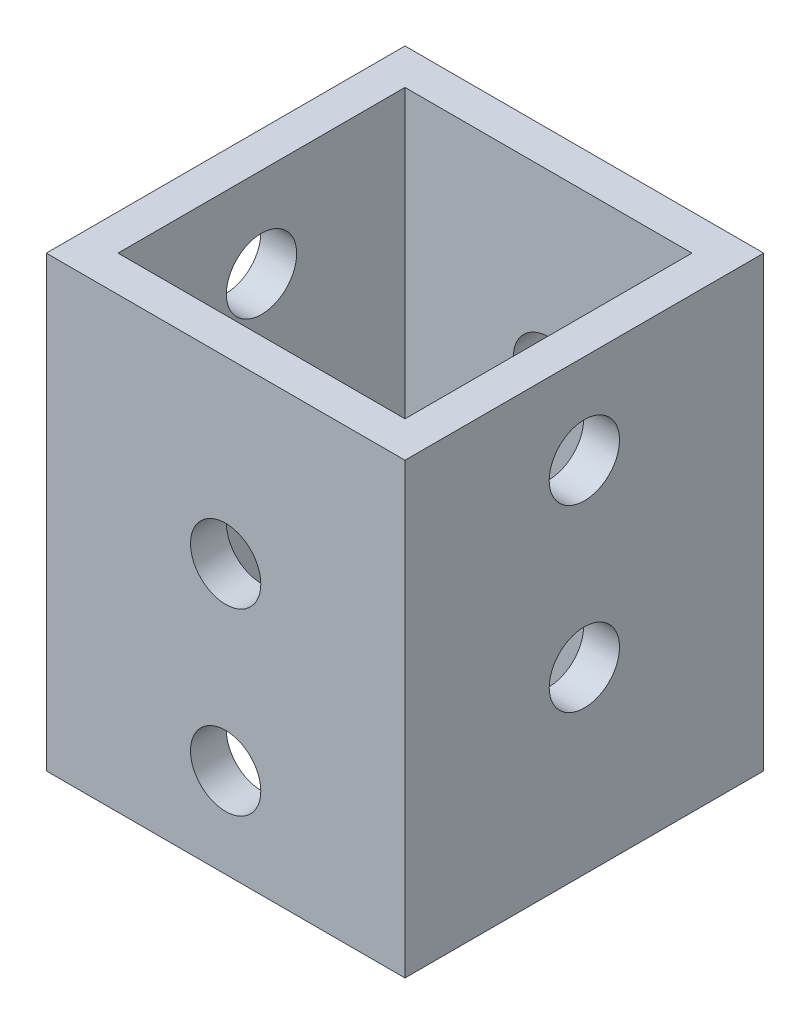
ISO-10303-21;
HEADER;
FILE_DESCRIPTION(('STEP AP214'),'2;1');
FILE_NAME('part.step','',(''),(''),'','','');
FILE_SCHEMA(('AUTOMOTIVE_DESIGN { 1 0 10303 214 1 1 1 1 }'));
ENDSEC;
DATA;
#1=APPLICATION_CONTEXT('core data for automotive mechanical design processes');
#2=APPLICATION_PROTOCOL_DEFINITION('international standard','automotive_design',2000,#1);
#3=PRODUCT_CONTEXT('',#1,'mechanical');
#4=PRODUCT('Part','Part','',(#3));
#5=PRODUCT_RELATED_PRODUCT_CATEGORY('part','',(#4));
#6=PRODUCT_DEFINITION_FORMATION('','',#4);
#7=PRODUCT_DEFINITION_CONTEXT('part definition',#1,'design');
#8=PRODUCT_DEFINITION('design','',#6,#7);
#9=PRODUCT_DEFINITION_SHAPE('','',#8);
#10=(LENGTH_UNIT() NAMED_UNIT(*) SI_UNIT(.MILLI.,.METRE.));
#11=(NAMED_UNIT(*) PLANE_ANGLE_UNIT() SI_UNIT($,.RADIAN.));
#12=(NAMED_UNIT(*) SI_UNIT($,.STERADIAN.) SOLID_ANGLE_UNIT());
#13=UNCERTAINTY_MEASURE_WITH_UNIT(LENGTH_MEASURE(1.E-05),#10,'distance_accuracy_value','');
#14=(GEOMETRIC_REPRESENTATION_CONTEXT(3) GLOBAL_UNCERTAINTY_ASSIGNED_CONTEXT((#13)) GLOBAL_UNIT_ASSIGNED_CONTEXT((#10,
#11,#12)) REPRESENTATION_CONTEXT('',''));
#15=CARTESIAN_POINT('',(0.,0.,0.));
#16=DIRECTION('',(0.,0.,1.));
#17=DIRECTION('',(1.,0.,0.));
#18=AXIS2_PLACEMENT_3D('',#15,#16,#17);
#19=CARTESIAN_POINT('',(0.,31.75,0.));
#20=DIRECTION('',(0.,1.,0.));
#21=DIRECTION('',(0.,0.,1.));
#22=AXIS2_PLACEMENT_3D('',#19,#20,#21);
#23=PLANE('',#22);
#24=DIRECTION('',(0.,0.,1.));
#25=VECTOR('',#24,1.);
#26=CARTESIAN_POINT('',(0.,31.75,0.));
#27=LINE('',#26,#25);
#28=CARTESIAN_POINT('',(0.,31.75,-25.4));
#29=VERTEX_POINT('',#28);
#30=CARTESIAN_POINT('',(0.,31.75,0.));
#31=VERTEX_POINT('',#30);
#32=EDGE_CURVE('E162',#29,#31,#27,.T.);
#33=ORIENTED_EDGE('',*,*,#32,.T.);
#34=DIRECTION('',(1.,0.,0.));
#35=VECTOR('',#34,1.);
#36=CARTESIAN_POINT('',(0.,31.75,0.));
#37=LINE('',#36,#35);
#38=CARTESIAN_POINT('',(25.4,31.75,0.));
#39=VERTEX_POINT('',#38);
#40=EDGE_CURVE('E165',#31,#39,#37,.T.);
#41=ORIENTED_EDGE('',*,*,#40,.T.);
#42=DIRECTION('',(0.,0.,-1.));
#43=VECTOR('',#42,1.);
#44=CARTESIAN_POINT('',(25.4,31.75,0.));
#45=LINE('',#44,#43);
#46=CARTESIAN_POINT('',(25.4,31.75,-25.4));
#47=VERTEX_POINT('',#46);
#48=EDGE_CURVE('E168',#39,#47,#45,.T.);
#49=ORIENTED_EDGE('',*,*,#48,.T.);
#50=DIRECTION('',(-1.,0.,0.));
#51=VECTOR('',#50,1.);
#52=CARTESIAN_POINT('',(0.,31.75,-25.4));
#53=LINE('',#52,#51);
#54=EDGE_CURVE('E170',#47,#29,#53,.T.);
#55=ORIENTED_EDGE('',*,*,#54,.T.);
#56=EDGE_LOOP('',(#33,#41,#49,#55));
#57=FACE_BOUND('',#56,.T.);
#58=DIRECTION('',(1.,0.,0.));
#59=VECTOR('',#58,1.);
#60=CARTESIAN_POINT('',(0.,31.75,-2.54));
#61=LINE('',#60,#59);
#62=CARTESIAN_POINT('',(2.54,31.75,-2.54));
#63=VERTEX_POINT('',#62);
#64=CARTESIAN_POINT('',(22.86,31.75,-2.54));
#65=VERTEX_POINT('',#64);
#66=EDGE_CURVE('E132',#63,#65,#61,.T.);
#67=ORIENTED_EDGE('',*,*,#66,.F.);
#68=DIRECTION('',(0.,0.,1.));
#69=VECTOR('',#68,1.);
#70=CARTESIAN_POINT('',(2.54,31.75,0.));
#71=LINE('',#70,#69);
#72=CARTESIAN_POINT('',(2.54,31.75,-22.86));
#73=VERTEX_POINT('',#72);
#74=EDGE_CURVE('E124',#73,#63,#71,.T.);
#75=ORIENTED_EDGE('',*,*,#74,.F.);
#76=DIRECTION('',(-1.,0.,0.));
#77=VECTOR('',#76,1.);
#78=CARTESIAN_POINT('',(0.,31.75,-22.86));
#79=LINE('',#78,#77);
#80=CARTESIAN_POINT('',(22.86,31.75,-22.86));
#81=VERTEX_POINT('',#80);
#82=EDGE_CURVE('E146',#81,#73,#79,.T.);
#83=ORIENTED_EDGE('',*,*,#82,.F.);
#84=DIRECTION('',(0.,0.,-1.));
#85=VECTOR('',#84,1.);
#86=CARTESIAN_POINT('',(22.86,31.75,0.));
#87=LINE('',#86,#85);
#88=EDGE_CURVE('E144',#65,#81,#87,.T.);
#89=ORIENTED_EDGE('',*,*,#88,.F.);
#90=EDGE_LOOP('',(#67,#75,#83,#89));
#91=FACE_BOUND('',#90,.T.);
#92=ADVANCED_FACE('F57',(#57,#91),#23,.T.);
#93=CARTESIAN_POINT('',(0.,0.,0.));
#94=DIRECTION('',(0.,1.,0.));
#95=DIRECTION('',(0.,0.,1.));
#96=AXIS2_PLACEMENT_3D('',#93,#94,#95);
#97=PLANE('',#96);
#98=DIRECTION('',(0.,0.,1.));
#99=VECTOR('',#98,1.);
#100=CARTESIAN_POINT('',(0.,0.,0.));
#101=LINE('',#100,#99);
#102=CARTESIAN_POINT('',(0.,0.,-25.4));
#103=VERTEX_POINT('',#102);
#104=CARTESIAN_POINT('',(0.,0.,0.));
#105=VERTEX_POINT('',#104);
#106=EDGE_CURVE('E140',#103,#105,#101,.T.);
#107=ORIENTED_EDGE('',*,*,#106,.F.);
#108=DIRECTION('',(-1.,0.,0.));
#109=VECTOR('',#108,1.);
#110=CARTESIAN_POINT('',(0.,0.,-25.4));
#111=LINE('',#110,#109);
#112=CARTESIAN_POINT('',(25.4,0.,-25.4));
#113=VERTEX_POINT('',#112);
#114=EDGE_CURVE('E166',#113,#103,#111,.T.);
#115=ORIENTED_EDGE('',*,*,#114,.F.);
#116=DIRECTION('',(0.,0.,-1.));
#117=VECTOR('',#116,1.);
#118=CARTESIAN_POINT('',(25.4,0.,0.));
#119=LINE('',#118,#117);
#120=CARTESIAN_POINT('',(25.4,0.,0.));
#121=VERTEX_POINT('',#120);
#122=EDGE_CURVE('E177',#121,#113,#119,.T.);
#123=ORIENTED_EDGE('',*,*,#122,.F.);
#124=DIRECTION('',(1.,0.,0.));
#125=VECTOR('',#124,1.);
#126=CARTESIAN_POINT('',(0.,0.,0.));
#127=LINE('',#126,#125);
#128=EDGE_CURVE('E175',#105,#121,#127,.T.);
#129=ORIENTED_EDGE('',*,*,#128,.F.);
#130=EDGE_LOOP('',(#107,#115,#123,#129));
#131=FACE_BOUND('',#130,.T.);
#132=DIRECTION('',(0.,0.,1.));
#133=VECTOR('',#132,1.);
#134=CARTESIAN_POINT('',(2.54,0.,0.));
#135=LINE('',#134,#133);
#136=CARTESIAN_POINT('',(2.54,0.,-22.86));
#137=VERTEX_POINT('',#136);
#138=CARTESIAN_POINT('',(2.54,0.,-2.54));
#139=VERTEX_POINT('',#138);
#140=EDGE_CURVE('E82',#137,#139,#135,.T.);
#141=ORIENTED_EDGE('',*,*,#140,.T.);
#142=DIRECTION('',(1.,0.,0.));
#143=VECTOR('',#142,1.);
#144=CARTESIAN_POINT('',(0.,0.,-2.54));
#145=LINE('',#144,#143);
#146=CARTESIAN_POINT('',(22.86,0.,-2.54));
#147=VERTEX_POINT('',#146);
#148=EDGE_CURVE('E139',#139,#147,#145,.T.);
#149=ORIENTED_EDGE('',*,*,#148,.T.);
#150=DIRECTION('',(0.,0.,-1.));
#151=VECTOR('',#150,1.);
#152=CARTESIAN_POINT('',(22.86,0.,0.));
#153=LINE('',#152,#151);
#154=CARTESIAN_POINT('',(22.86,0.,-22.86));
#155=VERTEX_POINT('',#154);
#156=EDGE_CURVE('E154',#147,#155,#153,.T.);
#157=ORIENTED_EDGE('',*,*,#156,.T.);
#158=DIRECTION('',(-1.,0.,0.));
#159=VECTOR('',#158,1.);
#160=CARTESIAN_POINT('',(0.,0.,-22.86));
#161=LINE('',#160,#159);
#162=EDGE_CURVE('E133',#155,#137,#161,.T.);
#163=ORIENTED_EDGE('',*,*,#162,.T.);
#164=EDGE_LOOP('',(#141,#149,#157,#163));
#165=FACE_BOUND('',#164,.T.);
#166=ADVANCED_FACE('F265',(#131,#165),#97,.F.);
#167=CARTESIAN_POINT('',(0.,31.75,0.));
#168=DIRECTION('',(1.,0.,0.));
#169=DIRECTION('',(0.,0.,-1.));
#170=AXIS2_PLACEMENT_3D('',#167,#168,#169);
#171=PLANE('',#170);
#172=CARTESIAN_POINT('',(0.,25.4000000000002,-12.7000000000002));
#173=DIRECTION('',(-1.,0.,0.));
#174=DIRECTION('',(0.,0.,1.));
#175=AXIS2_PLACEMENT_3D('',#172,#173,#174);
#176=CIRCLE('',#175,2.4892);
#177=CARTESIAN_POINT('',(0.,25.4000000000002,-10.2108000000002));
#178=VERTEX_POINT('',#177);
#179=EDGE_CURVE('E203',#178,#178,#176,.T.);
#180=ORIENTED_EDGE('',*,*,#179,.F.);
#181=EDGE_LOOP('',(#180));
#182=FACE_BOUND('',#181,.T.);
#183=CARTESIAN_POINT('',(0.,12.7000000000002,-12.7000000000002));
#184=DIRECTION('',(-1.,0.,0.));
#185=DIRECTION('',(0.,0.,1.));
#186=AXIS2_PLACEMENT_3D('',#183,#184,#185);
#187=CIRCLE('',#186,2.4892);
#188=CARTESIAN_POINT('',(0.,12.7000000000002,-10.2108000000002));
#189=VERTEX_POINT('',#188);
#190=EDGE_CURVE('E213',#189,#189,#187,.T.);
#191=ORIENTED_EDGE('',*,*,#190,.F.);
#192=EDGE_LOOP('',(#191));
#193=FACE_BOUND('',#192,.T.);
#194=ORIENTED_EDGE('',*,*,#106,.T.);
#195=DIRECTION('',(0.,-1.,0.));
#196=VECTOR('',#195,1.);
#197=CARTESIAN_POINT('',(0.,31.75,0.));
#198=LINE('',#197,#196);
#199=EDGE_CURVE('E12',#31,#105,#198,.T.);
#200=ORIENTED_EDGE('',*,*,#199,.F.);
#201=ORIENTED_EDGE('',*,*,#32,.F.);
#202=DIRECTION('',(0.,-1.,0.));
#203=VECTOR('',#202,1.);
#204=CARTESIAN_POINT('',(0.,31.75,-25.4));
#205=LINE('',#204,#203);
#206=EDGE_CURVE('E172',#29,#103,#205,.T.);
#207=ORIENTED_EDGE('',*,*,#206,.T.);
#208=EDGE_LOOP('',(#194,#200,#201,#207));
#209=FACE_BOUND('',#208,.T.);
#210=ADVANCED_FACE('F59',(#182,#193,#209),#171,.F.);
#211=CARTESIAN_POINT('',(0.,31.75,0.));
#212=DIRECTION('',(0.,0.,-1.));
#213=DIRECTION('',(-1.,0.,0.));
#214=AXIS2_PLACEMENT_3D('',#211,#212,#213);
#215=PLANE('',#214);
#216=CARTESIAN_POINT('',(12.7,19.0499999999999,0.));
#217=DIRECTION('',(0.,0.,1.));
#218=DIRECTION('',(1.,0.,0.));
#219=AXIS2_PLACEMENT_3D('',#216,#217,#218);
#220=CIRCLE('',#219,2.4892);
#221=CARTESIAN_POINT('',(15.1892,19.0499999999999,0.));
#222=VERTEX_POINT('',#221);
#223=EDGE_CURVE('E222',#222,#222,#220,.T.);
#224=ORIENTED_EDGE('',*,*,#223,.F.);
#225=EDGE_LOOP('',(#224));
#226=FACE_BOUND('',#225,.T.);
#227=CARTESIAN_POINT('',(12.7,6.34999999999989,0.));
#228=DIRECTION('',(0.,0.,1.));
#229=DIRECTION('',(1.,0.,0.));
#230=AXIS2_PLACEMENT_3D('',#227,#228,#229);
#231=CIRCLE('',#230,2.4892);
#232=CARTESIAN_POINT('',(15.1892,6.34999999999989,0.));
#233=VERTEX_POINT('',#232);
#234=EDGE_CURVE('E219',#233,#233,#231,.T.);
#235=ORIENTED_EDGE('',*,*,#234,.F.);
#236=EDGE_LOOP('',(#235));
#237=FACE_BOUND('',#236,.T.);
#238=ORIENTED_EDGE('',*,*,#128,.T.);
#239=DIRECTION('',(0.,-1.,0.));
#240=VECTOR('',#239,1.);
#241=CARTESIAN_POINT('',(25.4,31.75,0.));
#242=LINE('',#241,#240);
#243=EDGE_CURVE('E66',#39,#121,#242,.T.);
#244=ORIENTED_EDGE('',*,*,#243,.F.);
#245=ORIENTED_EDGE('',*,*,#40,.F.);
#246=ORIENTED_EDGE('',*,*,#199,.T.);
#247=EDGE_LOOP('',(#238,#244,#245,#246));
#248=FACE_BOUND('',#247,.T.);
#249=ADVANCED_FACE('F251',(#226,#237,#248),#215,.F.);
#250=CARTESIAN_POINT('',(25.4,31.75,0.));
#251=DIRECTION('',(-1.,0.,0.));
#252=DIRECTION('',(0.,0.,1.));
#253=AXIS2_PLACEMENT_3D('',#250,#251,#252);
#254=PLANE('',#253);
#255=CARTESIAN_POINT('',(25.4,25.4000000000002,-12.7000000000002));
#256=DIRECTION('',(-1.,0.,0.));
#257=DIRECTION('',(0.,0.,1.));
#258=AXIS2_PLACEMENT_3D('',#255,#256,#257);
#259=CIRCLE('',#258,2.4892);
#260=CARTESIAN_POINT('',(25.4,25.4000000000002,-10.2108000000002));
#261=VERTEX_POINT('',#260);
#262=EDGE_CURVE('E197',#261,#261,#259,.T.);
#263=ORIENTED_EDGE('',*,*,#262,.T.);
#264=EDGE_LOOP('',(#263));
#265=FACE_BOUND('',#264,.T.);
#266=CARTESIAN_POINT('',(25.4,12.7000000000002,-12.7000000000002));
#267=DIRECTION('',(-1.,0.,0.));
#268=DIRECTION('',(0.,0.,1.));
#269=AXIS2_PLACEMENT_3D('',#266,#267,#268);
#270=CIRCLE('',#269,2.4892);
#271=CARTESIAN_POINT('',(25.4,12.7000000000002,-10.2108000000002));
#272=VERTEX_POINT('',#271);
#273=EDGE_CURVE('E208',#272,#272,#270,.T.);
#274=ORIENTED_EDGE('',*,*,#273,.T.);
#275=EDGE_LOOP('',(#274));
#276=FACE_BOUND('',#275,.T.);
#277=ORIENTED_EDGE('',*,*,#122,.T.);
#278=DIRECTION('',(0.,-1.,0.));
#279=VECTOR('',#278,1.);
#280=CARTESIAN_POINT('',(25.4,31.75,-25.4));
#281=LINE('',#280,#279);
#282=EDGE_CURVE('E182',#47,#113,#281,.T.);
#283=ORIENTED_EDGE('',*,*,#282,.F.);
#284=ORIENTED_EDGE('',*,*,#48,.F.);
#285=ORIENTED_EDGE('',*,*,#243,.T.);
#286=EDGE_LOOP('',(#277,#283,#284,#285));
#287=FACE_BOUND('',#286,.T.);
#288=ADVANCED_FACE('F254',(#265,#276,#287),#254,.F.);
#289=CARTESIAN_POINT('',(0.,31.75,-25.4));
#290=DIRECTION('',(0.,0.,1.));
#291=DIRECTION('',(1.,0.,0.));
#292=AXIS2_PLACEMENT_3D('',#289,#290,#291);
#293=PLANE('',#292);
#294=CARTESIAN_POINT('',(12.7,19.0499999999999,-25.4));
#295=DIRECTION('',(0.,0.,1.));
#296=DIRECTION('',(1.,0.,0.));
#297=AXIS2_PLACEMENT_3D('',#294,#295,#296);
#298=CIRCLE('',#297,2.4892);
#299=CARTESIAN_POINT('',(15.1892,19.0499999999999,-25.4));
#300=VERTEX_POINT('',#299);
#301=EDGE_CURVE('E191',#300,#300,#298,.T.);
#302=ORIENTED_EDGE('',*,*,#301,.T.);
#303=EDGE_LOOP('',(#302));
#304=FACE_BOUND('',#303,.T.);
#305=CARTESIAN_POINT('',(12.7,6.34999999999989,-25.4));
#306=DIRECTION('',(0.,0.,1.));
#307=DIRECTION('',(1.,0.,0.));
#308=AXIS2_PLACEMENT_3D('',#305,#306,#307);
#309=CIRCLE('',#308,2.4892);
#310=CARTESIAN_POINT('',(15.1892,6.34999999999989,-25.4));
#311=VERTEX_POINT('',#310);
#312=EDGE_CURVE('E225',#311,#311,#309,.T.);
#313=ORIENTED_EDGE('',*,*,#312,.T.);
#314=EDGE_LOOP('',(#313));
#315=FACE_BOUND('',#314,.T.);
#316=ORIENTED_EDGE('',*,*,#114,.T.);
#317=ORIENTED_EDGE('',*,*,#206,.F.);
#318=ORIENTED_EDGE('',*,*,#54,.F.);
#319=ORIENTED_EDGE('',*,*,#282,.T.);
#320=EDGE_LOOP('',(#316,#317,#318,#319));
#321=FACE_BOUND('',#320,.T.);
#322=ADVANCED_FACE('F269',(#304,#315,#321),#293,.F.);
#323=CARTESIAN_POINT('',(2.54,31.75,0.));
#324=DIRECTION('',(1.,0.,0.));
#325=DIRECTION('',(0.,0.,-1.));
#326=AXIS2_PLACEMENT_3D('',#323,#324,#325);
#327=PLANE('',#326);
#328=CARTESIAN_POINT('',(2.54,25.4000000000002,-12.7000000000002));
#329=DIRECTION('',(1.,0.,0.));
#330=DIRECTION('',(0.,0.,-1.));
#331=AXIS2_PLACEMENT_3D('',#328,#329,#330);
#332=CIRCLE('',#331,2.4892);
#333=CARTESIAN_POINT('',(2.54,25.4000000000002,-15.1892000000002));
#334=VERTEX_POINT('',#333);
#335=EDGE_CURVE('E216',#334,#334,#332,.T.);
#336=ORIENTED_EDGE('',*,*,#335,.F.);
#337=EDGE_LOOP('',(#336));
#338=FACE_BOUND('',#337,.T.);
#339=CARTESIAN_POINT('',(2.54,12.7000000000002,-12.7000000000002));
#340=DIRECTION('',(1.,0.,0.));
#341=DIRECTION('',(0.,0.,-1.));
#342=AXIS2_PLACEMENT_3D('',#339,#340,#341);
#343=CIRCLE('',#342,2.4892);
#344=CARTESIAN_POINT('',(2.54,12.7000000000002,-15.1892000000002));
#345=VERTEX_POINT('',#344);
#346=EDGE_CURVE('E196',#345,#345,#343,.T.);
#347=ORIENTED_EDGE('',*,*,#346,.F.);
#348=EDGE_LOOP('',(#347));
#349=FACE_BOUND('',#348,.T.);
#350=ORIENTED_EDGE('',*,*,#140,.F.);
#351=DIRECTION('',(0.,-1.,0.));
#352=VECTOR('',#351,1.);
#353=CARTESIAN_POINT('',(2.54,31.75,-22.86));
#354=LINE('',#353,#352);
#355=EDGE_CURVE('E128',#73,#137,#354,.T.);
#356=ORIENTED_EDGE('',*,*,#355,.F.);
#357=ORIENTED_EDGE('',*,*,#74,.T.);
#358=DIRECTION('',(0.,-1.,0.));
#359=VECTOR('',#358,1.);
#360=CARTESIAN_POINT('',(2.54,31.75,-2.54));
#361=LINE('',#360,#359);
#362=EDGE_CURVE('E127',#63,#139,#361,.T.);
#363=ORIENTED_EDGE('',*,*,#362,.T.);
#364=EDGE_LOOP('',(#350,#356,#357,#363));
#365=FACE_BOUND('',#364,.T.);
#366=ADVANCED_FACE('F126',(#338,#349,#365),#327,.T.);
#367=CARTESIAN_POINT('',(0.,31.75,-2.54));
#368=DIRECTION('',(0.,0.,-1.));
#369=DIRECTION('',(-1.,0.,0.));
#370=AXIS2_PLACEMENT_3D('',#367,#368,#369);
#371=PLANE('',#370);
#372=CARTESIAN_POINT('',(12.7,19.0499999999999,-2.54));
#373=DIRECTION('',(0.,0.,-1.));
#374=DIRECTION('',(-1.,0.,0.));
#375=AXIS2_PLACEMENT_3D('',#372,#373,#374);
#376=CIRCLE('',#375,2.4892);
#377=CARTESIAN_POINT('',(10.2108,19.0499999999999,-2.54));
#378=VERTEX_POINT('',#377);
#379=EDGE_CURVE('E152',#378,#378,#376,.T.);
#380=ORIENTED_EDGE('',*,*,#379,.F.);
#381=EDGE_LOOP('',(#380));
#382=FACE_BOUND('',#381,.T.);
#383=CARTESIAN_POINT('',(12.7,6.34999999999989,-2.54));
#384=DIRECTION('',(0.,0.,-1.));
#385=DIRECTION('',(-1.,0.,0.));
#386=AXIS2_PLACEMENT_3D('',#383,#384,#385);
#387=CIRCLE('',#386,2.4892);
#388=CARTESIAN_POINT('',(10.2108,6.34999999999989,-2.54));
#389=VERTEX_POINT('',#388);
#390=EDGE_CURVE('E190',#389,#389,#387,.T.);
#391=ORIENTED_EDGE('',*,*,#390,.F.);
#392=EDGE_LOOP('',(#391));
#393=FACE_BOUND('',#392,.T.);
#394=ORIENTED_EDGE('',*,*,#148,.F.);
#395=ORIENTED_EDGE('',*,*,#362,.F.);
#396=ORIENTED_EDGE('',*,*,#66,.T.);
#397=DIRECTION('',(0.,-1.,0.));
#398=VECTOR('',#397,1.);
#399=CARTESIAN_POINT('',(22.86,31.75,-2.54));
#400=LINE('',#399,#398);
#401=EDGE_CURVE('E141',#65,#147,#400,.T.);
#402=ORIENTED_EDGE('',*,*,#401,.T.);
#403=EDGE_LOOP('',(#394,#395,#396,#402));
#404=FACE_BOUND('',#403,.T.);
#405=ADVANCED_FACE('F136',(#382,#393,#404),#371,.T.);
#406=CARTESIAN_POINT('',(22.86,31.75,0.));
#407=DIRECTION('',(-1.,0.,0.));
#408=DIRECTION('',(0.,0.,1.));
#409=AXIS2_PLACEMENT_3D('',#406,#407,#408);
#410=PLANE('',#409);
#411=CARTESIAN_POINT('',(22.86,25.4000000000002,-12.7000000000002));
#412=DIRECTION('',(-1.,0.,0.));
#413=DIRECTION('',(0.,0.,1.));
#414=AXIS2_PLACEMENT_3D('',#411,#412,#413);
#415=CIRCLE('',#414,2.4892);
#416=CARTESIAN_POINT('',(22.86,25.4000000000002,-10.2108000000002));
#417=VERTEX_POINT('',#416);
#418=EDGE_CURVE('E61',#417,#417,#415,.T.);
#419=ORIENTED_EDGE('',*,*,#418,.F.);
#420=EDGE_LOOP('',(#419));
#421=FACE_BOUND('',#420,.T.);
#422=CARTESIAN_POINT('',(22.86,12.7000000000002,-12.7000000000002));
#423=DIRECTION('',(-1.,0.,0.));
#424=DIRECTION('',(0.,0.,1.));
#425=AXIS2_PLACEMENT_3D('',#422,#423,#424);
#426=CIRCLE('',#425,2.4892);
#427=CARTESIAN_POINT('',(22.86,12.7000000000002,-10.2108000000002));
#428=VERTEX_POINT('',#427);
#429=EDGE_CURVE('E194',#428,#428,#426,.T.);
#430=ORIENTED_EDGE('',*,*,#429,.F.);
#431=EDGE_LOOP('',(#430));
#432=FACE_BOUND('',#431,.T.);
#433=ORIENTED_EDGE('',*,*,#156,.F.);
#434=ORIENTED_EDGE('',*,*,#401,.F.);
#435=ORIENTED_EDGE('',*,*,#88,.T.);
#436=DIRECTION('',(0.,-1.,0.));
#437=VECTOR('',#436,1.);
#438=CARTESIAN_POINT('',(22.86,31.75,-22.86));
#439=LINE('',#438,#437);
#440=EDGE_CURVE('E74',#81,#155,#439,.T.);
#441=ORIENTED_EDGE('',*,*,#440,.T.);
#442=EDGE_LOOP('',(#433,#434,#435,#441));
#443=FACE_BOUND('',#442,.T.);
#444=ADVANCED_FACE('F239',(#421,#432,#443),#410,.T.);
#445=CARTESIAN_POINT('',(0.,31.75,-22.86));
#446=DIRECTION('',(0.,0.,1.));
#447=DIRECTION('',(1.,0.,0.));
#448=AXIS2_PLACEMENT_3D('',#445,#446,#447);
#449=PLANE('',#448);
#450=CARTESIAN_POINT('',(12.7,19.0499999999999,-22.86));
#451=DIRECTION('',(0.,0.,1.));
#452=DIRECTION('',(1.,0.,0.));
#453=AXIS2_PLACEMENT_3D('',#450,#451,#452);
#454=CIRCLE('',#453,2.4892);
#455=CARTESIAN_POINT('',(15.1892,19.0499999999999,-22.86));
#456=VERTEX_POINT('',#455);
#457=EDGE_CURVE('E192',#456,#456,#454,.T.);
#458=ORIENTED_EDGE('',*,*,#457,.F.);
#459=EDGE_LOOP('',(#458));
#460=FACE_BOUND('',#459,.T.);
#461=CARTESIAN_POINT('',(12.7,6.34999999999989,-22.86));
#462=DIRECTION('',(0.,0.,1.));
#463=DIRECTION('',(1.,0.,0.));
#464=AXIS2_PLACEMENT_3D('',#461,#462,#463);
#465=CIRCLE('',#464,2.4892);
#466=CARTESIAN_POINT('',(15.1892,6.34999999999989,-22.86));
#467=VERTEX_POINT('',#466);
#468=EDGE_CURVE('E187',#467,#467,#465,.T.);
#469=ORIENTED_EDGE('',*,*,#468,.F.);
#470=EDGE_LOOP('',(#469));
#471=FACE_BOUND('',#470,.T.);
#472=ORIENTED_EDGE('',*,*,#162,.F.);
#473=ORIENTED_EDGE('',*,*,#440,.F.);
#474=ORIENTED_EDGE('',*,*,#82,.T.);
#475=ORIENTED_EDGE('',*,*,#355,.T.);
#476=EDGE_LOOP('',(#472,#473,#474,#475));
#477=FACE_BOUND('',#476,.T.);
#478=ADVANCED_FACE('F350',(#460,#471,#477),#449,.T.);
#479=CARTESIAN_POINT('',(12.7,6.34999999999989,-25.4));
#480=DIRECTION('',(0.,0.,1.));
#481=DIRECTION('',(1.,0.,0.));
#482=AXIS2_PLACEMENT_3D('',#479,#480,#481);
#483=CYLINDRICAL_SURFACE('',#482,2.4892);
#484=ORIENTED_EDGE('',*,*,#468,.T.);
#485=EDGE_LOOP('',(#484));
#486=FACE_BOUND('',#485,.T.);
#487=ORIENTED_EDGE('',*,*,#312,.F.);
#488=EDGE_LOOP('',(#487));
#489=FACE_BOUND('',#488,.T.);
#490=ADVANCED_FACE('F248',(#486,#489),#483,.F.);
#491=CARTESIAN_POINT('',(12.7,19.0499999999999,-25.4));
#492=DIRECTION('',(0.,0.,1.));
#493=DIRECTION('',(1.,0.,0.));
#494=AXIS2_PLACEMENT_3D('',#491,#492,#493);
#495=CYLINDRICAL_SURFACE('',#494,2.4892);
#496=ORIENTED_EDGE('',*,*,#457,.T.);
#497=EDGE_LOOP('',(#496));
#498=FACE_BOUND('',#497,.T.);
#499=ORIENTED_EDGE('',*,*,#301,.F.);
#500=EDGE_LOOP('',(#499));
#501=FACE_BOUND('',#500,.T.);
#502=ADVANCED_FACE('F246',(#498,#501),#495,.F.);
#503=ORIENTED_EDGE('',*,*,#390,.T.);
#504=EDGE_LOOP('',(#503));
#505=FACE_BOUND('',#504,.T.);
#506=ORIENTED_EDGE('',*,*,#234,.T.);
#507=EDGE_LOOP('',(#506));
#508=FACE_BOUND('',#507,.T.);
#509=ADVANCED_FACE('F243',(#505,#508),#483,.F.);
#510=ORIENTED_EDGE('',*,*,#379,.T.);
#511=EDGE_LOOP('',(#510));
#512=FACE_BOUND('',#511,.T.);
#513=ORIENTED_EDGE('',*,*,#223,.T.);
#514=EDGE_LOOP('',(#513));
#515=FACE_BOUND('',#514,.T.);
#516=ADVANCED_FACE('F234',(#512,#515),#495,.F.);
#517=CARTESIAN_POINT('',(25.4,12.7000000000002,-12.7000000000002));
#518=DIRECTION('',(-1.,0.,0.));
#519=DIRECTION('',(0.,0.,1.));
#520=AXIS2_PLACEMENT_3D('',#517,#518,#519);
#521=CYLINDRICAL_SURFACE('',#520,2.4892);
#522=ORIENTED_EDGE('',*,*,#429,.T.);
#523=EDGE_LOOP('',(#522));
#524=FACE_BOUND('',#523,.T.);
#525=ORIENTED_EDGE('',*,*,#273,.F.);
#526=EDGE_LOOP('',(#525));
#527=FACE_BOUND('',#526,.T.);
#528=ADVANCED_FACE('F293',(#524,#527),#521,.F.);
#529=CARTESIAN_POINT('',(25.4,25.4000000000002,-12.7000000000002));
#530=DIRECTION('',(-1.,0.,0.));
#531=DIRECTION('',(0.,0.,1.));
#532=AXIS2_PLACEMENT_3D('',#529,#530,#531);
#533=CYLINDRICAL_SURFACE('',#532,2.4892);
#534=ORIENTED_EDGE('',*,*,#418,.T.);
#535=EDGE_LOOP('',(#534));
#536=FACE_BOUND('',#535,.T.);
#537=ORIENTED_EDGE('',*,*,#262,.F.);
#538=EDGE_LOOP('',(#537));
#539=FACE_BOUND('',#538,.T.);
#540=ADVANCED_FACE('F295',(#536,#539),#533,.F.);
#541=ORIENTED_EDGE('',*,*,#346,.T.);
#542=EDGE_LOOP('',(#541));
#543=FACE_BOUND('',#542,.T.);
#544=ORIENTED_EDGE('',*,*,#190,.T.);
#545=EDGE_LOOP('',(#544));
#546=FACE_BOUND('',#545,.T.);
#547=ADVANCED_FACE('F297',(#543,#546),#521,.F.);
#548=ORIENTED_EDGE('',*,*,#335,.T.);
#549=EDGE_LOOP('',(#548));
#550=FACE_BOUND('',#549,.T.);
#551=ORIENTED_EDGE('',*,*,#179,.T.);
#552=EDGE_LOOP('',(#551));
#553=FACE_BOUND('',#552,.T.);
#554=ADVANCED_FACE('F304',(#550,#553),#533,.F.);
#555=CLOSED_SHELL('',(#92,#166,#210,#249,#288,#322,#366,#405,#444,#478,#490,#502,#509,#516,#528,
#540,#547,#554));
#556=MANIFOLD_SOLID_BREP('B2',#555);
#557=ADVANCED_BREP_SHAPE_REPRESENTATION('',(#18,#556),#14);
#558=SHAPE_DEFINITION_REPRESENTATION(#9,#557);
ENDSEC;
END-ISO-10303-21;
